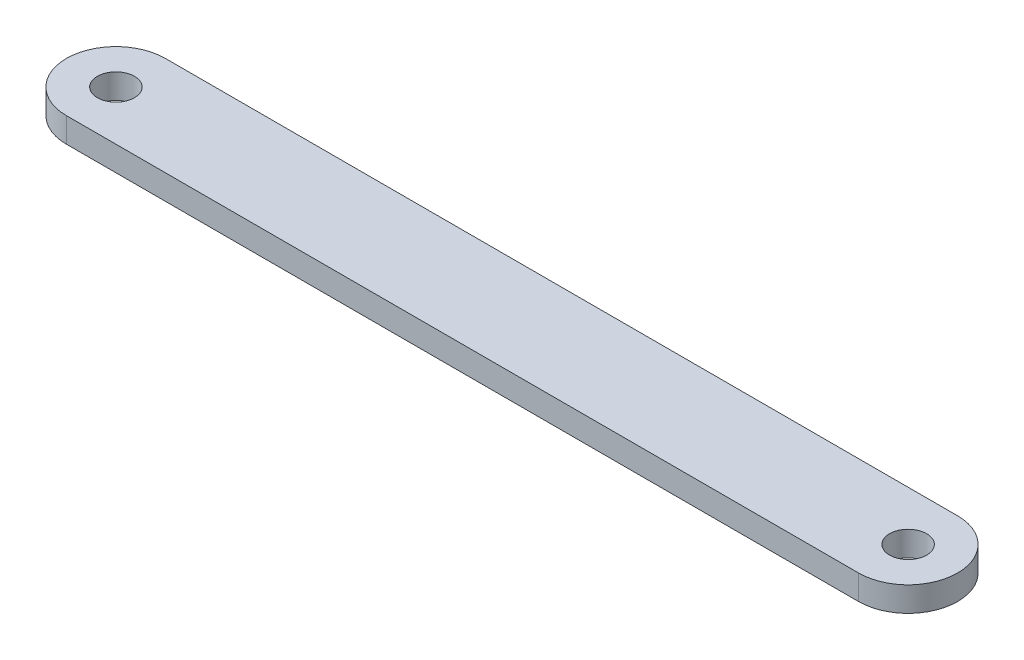
ISO-10303-21;
HEADER;
FILE_DESCRIPTION(('STEP AP214'),'2;1');
FILE_NAME('part.step','',(''),(''),'','','');
FILE_SCHEMA(('AUTOMOTIVE_DESIGN { 1 0 10303 214 1 1 1 1 }'));
ENDSEC;
DATA;
#1=APPLICATION_CONTEXT('core data for automotive mechanical design processes');
#2=APPLICATION_PROTOCOL_DEFINITION('international standard','automotive_design',2000,#1);
#3=PRODUCT_CONTEXT('',#1,'mechanical');
#4=PRODUCT('Part','Part','',(#3));
#5=PRODUCT_RELATED_PRODUCT_CATEGORY('part','',(#4));
#6=PRODUCT_DEFINITION_FORMATION('','',#4);
#7=PRODUCT_DEFINITION_CONTEXT('part definition',#1,'design');
#8=PRODUCT_DEFINITION('design','',#6,#7);
#9=PRODUCT_DEFINITION_SHAPE('','',#8);
#10=(LENGTH_UNIT() NAMED_UNIT(*) SI_UNIT(.MILLI.,.METRE.));
#11=(NAMED_UNIT(*) PLANE_ANGLE_UNIT() SI_UNIT($,.RADIAN.));
#12=(NAMED_UNIT(*) SI_UNIT($,.STERADIAN.) SOLID_ANGLE_UNIT());
#13=UNCERTAINTY_MEASURE_WITH_UNIT(LENGTH_MEASURE(1.E-05),#10,'distance_accuracy_value','');
#14=(GEOMETRIC_REPRESENTATION_CONTEXT(3) GLOBAL_UNCERTAINTY_ASSIGNED_CONTEXT((#13)) GLOBAL_UNIT_ASSIGNED_CONTEXT((#10,
#11,#12)) REPRESENTATION_CONTEXT('',''));
#15=CARTESIAN_POINT('',(0.,0.,0.));
#16=DIRECTION('',(0.,0.,1.));
#17=DIRECTION('',(1.,0.,0.));
#18=AXIS2_PLACEMENT_3D('',#15,#16,#17);
#19=CARTESIAN_POINT('',(-101.6,6.35,0.));
#20=DIRECTION('',(0.,1.,0.));
#21=DIRECTION('',(0.,0.,1.));
#22=AXIS2_PLACEMENT_3D('',#19,#20,#21);
#23=PLANE('',#22);
#24=CARTESIAN_POINT('',(-101.6,6.35,0.));
#25=DIRECTION('',(0.,1.,0.));
#26=DIRECTION('',(0.,0.,1.));
#27=AXIS2_PLACEMENT_3D('',#24,#25,#26);
#28=CIRCLE('',#27,4.7625);
#29=CARTESIAN_POINT('',(-101.6,6.35,4.7625));
#30=VERTEX_POINT('',#29);
#31=EDGE_CURVE('E100',#30,#30,#28,.T.);
#32=ORIENTED_EDGE('',*,*,#31,.F.);
#33=EDGE_LOOP('',(#32));
#34=FACE_BOUND('',#33,.T.);
#35=CARTESIAN_POINT('',(-101.6,6.35,0.));
#36=DIRECTION('',(0.,1.,0.));
#37=DIRECTION('',(0.,0.,1.));
#38=AXIS2_PLACEMENT_3D('',#35,#36,#37);
#39=CIRCLE('',#38,12.7);
#40=CARTESIAN_POINT('',(-101.6,6.35,-12.7));
#41=VERTEX_POINT('',#40);
#42=CARTESIAN_POINT('',(-101.6,6.35,12.7));
#43=VERTEX_POINT('',#42);
#44=EDGE_CURVE('E85',#41,#43,#39,.T.);
#45=ORIENTED_EDGE('',*,*,#44,.T.);
#46=DIRECTION('',(1.,0.,0.));
#47=VECTOR('',#46,1.);
#48=CARTESIAN_POINT('',(-101.6,6.35,12.7));
#49=LINE('',#48,#47);
#50=CARTESIAN_POINT('',(101.6,6.35,12.7));
#51=VERTEX_POINT('',#50);
#52=EDGE_CURVE('E80',#43,#51,#49,.T.);
#53=ORIENTED_EDGE('',*,*,#52,.T.);
#54=CARTESIAN_POINT('',(101.6,6.35,0.));
#55=DIRECTION('',(0.,1.,0.));
#56=DIRECTION('',(0.,0.,1.));
#57=AXIS2_PLACEMENT_3D('',#54,#55,#56);
#58=CIRCLE('',#57,12.7);
#59=CARTESIAN_POINT('',(101.6,6.35,-12.7));
#60=VERTEX_POINT('',#59);
#61=EDGE_CURVE('E83',#51,#60,#58,.T.);
#62=ORIENTED_EDGE('',*,*,#61,.T.);
#63=DIRECTION('',(-1.,0.,0.));
#64=VECTOR('',#63,1.);
#65=CARTESIAN_POINT('',(-101.6,6.35,-12.7));
#66=LINE('',#65,#64);
#67=EDGE_CURVE('E50',#60,#41,#66,.T.);
#68=ORIENTED_EDGE('',*,*,#67,.T.);
#69=EDGE_LOOP('',(#45,#53,#62,#68));
#70=FACE_BOUND('',#69,.T.);
#71=CARTESIAN_POINT('',(101.6,6.35,0.));
#72=DIRECTION('',(0.,1.,0.));
#73=DIRECTION('',(0.,0.,1.));
#74=AXIS2_PLACEMENT_3D('',#71,#72,#73);
#75=CIRCLE('',#74,4.7625);
#76=CARTESIAN_POINT('',(101.6,6.35,4.76249999999996));
#77=VERTEX_POINT('',#76);
#78=EDGE_CURVE('E115',#77,#77,#75,.T.);
#79=ORIENTED_EDGE('',*,*,#78,.F.);
#80=EDGE_LOOP('',(#79));
#81=FACE_BOUND('',#80,.T.);
#82=ADVANCED_FACE('F33',(#34,#70,#81),#23,.T.);
#83=CARTESIAN_POINT('',(-101.6,0.,0.));
#84=DIRECTION('',(0.,1.,0.));
#85=DIRECTION('',(0.,0.,1.));
#86=AXIS2_PLACEMENT_3D('',#83,#84,#85);
#87=PLANE('',#86);
#88=CARTESIAN_POINT('',(-101.6,0.,0.));
#89=DIRECTION('',(0.,1.,0.));
#90=DIRECTION('',(0.,0.,1.));
#91=AXIS2_PLACEMENT_3D('',#88,#89,#90);
#92=CIRCLE('',#91,12.7);
#93=CARTESIAN_POINT('',(-101.6,0.,-12.7));
#94=VERTEX_POINT('',#93);
#95=CARTESIAN_POINT('',(-101.6,0.,12.7));
#96=VERTEX_POINT('',#95);
#97=EDGE_CURVE('E97',#94,#96,#92,.T.);
#98=ORIENTED_EDGE('',*,*,#97,.F.);
#99=DIRECTION('',(-1.,0.,0.));
#100=VECTOR('',#99,1.);
#101=CARTESIAN_POINT('',(-101.6,0.,-12.7));
#102=LINE('',#101,#100);
#103=CARTESIAN_POINT('',(101.6,0.,-12.7));
#104=VERTEX_POINT('',#103);
#105=EDGE_CURVE('E73',#104,#94,#102,.T.);
#106=ORIENTED_EDGE('',*,*,#105,.F.);
#107=CARTESIAN_POINT('',(101.6,0.,0.));
#108=DIRECTION('',(0.,1.,0.));
#109=DIRECTION('',(0.,0.,1.));
#110=AXIS2_PLACEMENT_3D('',#107,#108,#109);
#111=CIRCLE('',#110,12.7);
#112=CARTESIAN_POINT('',(101.6,0.,12.7));
#113=VERTEX_POINT('',#112);
#114=EDGE_CURVE('E67',#113,#104,#111,.T.);
#115=ORIENTED_EDGE('',*,*,#114,.F.);
#116=DIRECTION('',(1.,0.,0.));
#117=VECTOR('',#116,1.);
#118=CARTESIAN_POINT('',(-101.6,0.,12.7));
#119=LINE('',#118,#117);
#120=EDGE_CURVE('E89',#96,#113,#119,.T.);
#121=ORIENTED_EDGE('',*,*,#120,.F.);
#122=EDGE_LOOP('',(#98,#106,#115,#121));
#123=FACE_BOUND('',#122,.T.);
#124=CARTESIAN_POINT('',(-101.6,0.,0.));
#125=DIRECTION('',(0.,1.,0.));
#126=DIRECTION('',(0.,0.,1.));
#127=AXIS2_PLACEMENT_3D('',#124,#125,#126);
#128=CIRCLE('',#127,4.7625);
#129=CARTESIAN_POINT('',(-101.6,0.,4.7625));
#130=VERTEX_POINT('',#129);
#131=EDGE_CURVE('E112',#130,#130,#128,.T.);
#132=ORIENTED_EDGE('',*,*,#131,.T.);
#133=EDGE_LOOP('',(#132));
#134=FACE_BOUND('',#133,.T.);
#135=CARTESIAN_POINT('',(101.6,0.,0.));
#136=DIRECTION('',(0.,1.,0.));
#137=DIRECTION('',(0.,0.,1.));
#138=AXIS2_PLACEMENT_3D('',#135,#136,#137);
#139=CIRCLE('',#138,4.7625);
#140=CARTESIAN_POINT('',(101.6,0.,4.76249999999996));
#141=VERTEX_POINT('',#140);
#142=EDGE_CURVE('E118',#141,#141,#139,.T.);
#143=ORIENTED_EDGE('',*,*,#142,.T.);
#144=EDGE_LOOP('',(#143));
#145=FACE_BOUND('',#144,.T.);
#146=ADVANCED_FACE('F108',(#123,#134,#145),#87,.F.);
#147=CARTESIAN_POINT('',(-101.6,6.35,0.));
#148=DIRECTION('',(0.,-1.,0.));
#149=DIRECTION('',(0.,0.,-1.));
#150=AXIS2_PLACEMENT_3D('',#147,#148,#149);
#151=CYLINDRICAL_SURFACE('',#150,12.7);
#152=ORIENTED_EDGE('',*,*,#97,.T.);
#153=DIRECTION('',(0.,-1.,0.));
#154=VECTOR('',#153,1.);
#155=CARTESIAN_POINT('',(-101.6,6.35,12.7));
#156=LINE('',#155,#154);
#157=EDGE_CURVE('E11',#43,#96,#156,.T.);
#158=ORIENTED_EDGE('',*,*,#157,.F.);
#159=ORIENTED_EDGE('',*,*,#44,.F.);
#160=DIRECTION('',(0.,-1.,0.));
#161=VECTOR('',#160,1.);
#162=CARTESIAN_POINT('',(-101.6,6.35,-12.7));
#163=LINE('',#162,#161);
#164=EDGE_CURVE('E93',#41,#94,#163,.T.);
#165=ORIENTED_EDGE('',*,*,#164,.T.);
#166=EDGE_LOOP('',(#152,#158,#159,#165));
#167=FACE_BOUND('',#166,.T.);
#168=ADVANCED_FACE('F35',(#167),#151,.T.);
#169=CARTESIAN_POINT('',(-101.6,6.35,12.7));
#170=DIRECTION('',(0.,0.,-1.));
#171=DIRECTION('',(-1.,0.,0.));
#172=AXIS2_PLACEMENT_3D('',#169,#170,#171);
#173=PLANE('',#172);
#174=ORIENTED_EDGE('',*,*,#120,.T.);
#175=DIRECTION('',(0.,-1.,0.));
#176=VECTOR('',#175,1.);
#177=CARTESIAN_POINT('',(101.6,6.35,12.7));
#178=LINE('',#177,#176);
#179=EDGE_CURVE('E42',#51,#113,#178,.T.);
#180=ORIENTED_EDGE('',*,*,#179,.F.);
#181=ORIENTED_EDGE('',*,*,#52,.F.);
#182=ORIENTED_EDGE('',*,*,#157,.T.);
#183=EDGE_LOOP('',(#174,#180,#181,#182));
#184=FACE_BOUND('',#183,.T.);
#185=ADVANCED_FACE('F88',(#184),#173,.F.);
#186=CARTESIAN_POINT('',(101.6,6.35,0.));
#187=DIRECTION('',(0.,-1.,0.));
#188=DIRECTION('',(0.,0.,-1.));
#189=AXIS2_PLACEMENT_3D('',#186,#187,#188);
#190=CYLINDRICAL_SURFACE('',#189,12.7);
#191=ORIENTED_EDGE('',*,*,#114,.T.);
#192=DIRECTION('',(0.,-1.,0.));
#193=VECTOR('',#192,1.);
#194=CARTESIAN_POINT('',(101.6,6.35,-12.7));
#195=LINE('',#194,#193);
#196=EDGE_CURVE('E90',#60,#104,#195,.T.);
#197=ORIENTED_EDGE('',*,*,#196,.F.);
#198=ORIENTED_EDGE('',*,*,#61,.F.);
#199=ORIENTED_EDGE('',*,*,#179,.T.);
#200=EDGE_LOOP('',(#191,#197,#198,#199));
#201=FACE_BOUND('',#200,.T.);
#202=ADVANCED_FACE('F91',(#201),#190,.T.);
#203=CARTESIAN_POINT('',(-101.6,6.35,-12.7));
#204=DIRECTION('',(0.,0.,1.));
#205=DIRECTION('',(1.,0.,0.));
#206=AXIS2_PLACEMENT_3D('',#203,#204,#205);
#207=PLANE('',#206);
#208=ORIENTED_EDGE('',*,*,#105,.T.);
#209=ORIENTED_EDGE('',*,*,#164,.F.);
#210=ORIENTED_EDGE('',*,*,#67,.F.);
#211=ORIENTED_EDGE('',*,*,#196,.T.);
#212=EDGE_LOOP('',(#208,#209,#210,#211));
#213=FACE_BOUND('',#212,.T.);
#214=ADVANCED_FACE('F105',(#213),#207,.F.);
#215=CARTESIAN_POINT('',(-101.6,6.35,0.));
#216=DIRECTION('',(0.,-1.,0.));
#217=DIRECTION('',(0.,0.,-1.));
#218=AXIS2_PLACEMENT_3D('',#215,#216,#217);
#219=CYLINDRICAL_SURFACE('',#218,4.7625);
#220=ORIENTED_EDGE('',*,*,#31,.T.);
#221=EDGE_LOOP('',(#220));
#222=FACE_BOUND('',#221,.T.);
#223=ORIENTED_EDGE('',*,*,#131,.F.);
#224=EDGE_LOOP('',(#223));
#225=FACE_BOUND('',#224,.T.);
#226=ADVANCED_FACE('F135',(#222,#225),#219,.F.);
#227=CARTESIAN_POINT('',(101.6,6.35,0.));
#228=DIRECTION('',(0.,-1.,0.));
#229=DIRECTION('',(0.,0.,-1.));
#230=AXIS2_PLACEMENT_3D('',#227,#228,#229);
#231=CYLINDRICAL_SURFACE('',#230,4.7625);
#232=ORIENTED_EDGE('',*,*,#78,.T.);
#233=EDGE_LOOP('',(#232));
#234=FACE_BOUND('',#233,.T.);
#235=ORIENTED_EDGE('',*,*,#142,.F.);
#236=EDGE_LOOP('',(#235));
#237=FACE_BOUND('',#236,.T.);
#238=ADVANCED_FACE('F124',(#234,#237),#231,.F.);
#239=CLOSED_SHELL('',(#82,#146,#168,#185,#202,#214,#226,#238));
#240=MANIFOLD_SOLID_BREP('B2',#239);
#241=ADVANCED_BREP_SHAPE_REPRESENTATION('',(#18,#240),#14);
#242=SHAPE_DEFINITION_REPRESENTATION(#9,#241);
ENDSEC;
END-ISO-10303-21;
